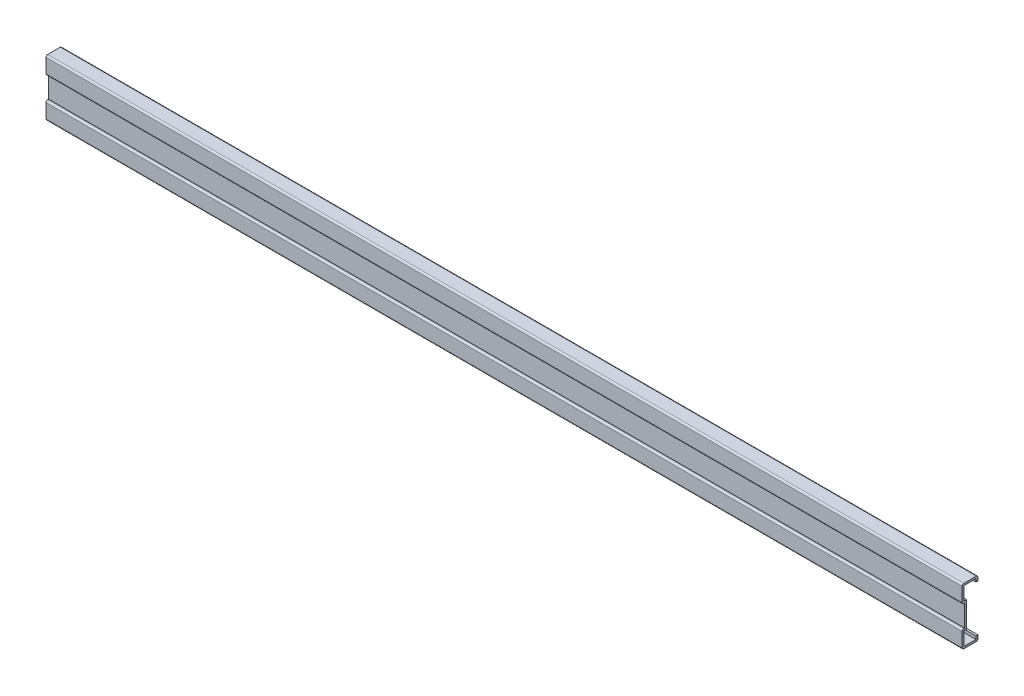
ISO-10303-21;
HEADER;
FILE_DESCRIPTION(('STEP AP214'),'2;1');
FILE_NAME('part.step','',(''),(''),'','','');
FILE_SCHEMA(('AUTOMOTIVE_DESIGN { 1 0 10303 214 1 1 1 1 }'));
ENDSEC;
DATA;
#1=APPLICATION_CONTEXT('core data for automotive mechanical design processes');
#2=APPLICATION_PROTOCOL_DEFINITION('international standard','automotive_design',2000,#1);
#3=PRODUCT_CONTEXT('',#1,'mechanical');
#4=PRODUCT('Part','Part','',(#3));
#5=PRODUCT_RELATED_PRODUCT_CATEGORY('part','',(#4));
#6=PRODUCT_DEFINITION_FORMATION('','',#4);
#7=PRODUCT_DEFINITION_CONTEXT('part definition',#1,'design');
#8=PRODUCT_DEFINITION('design','',#6,#7);
#9=PRODUCT_DEFINITION_SHAPE('','',#8);
#10=(LENGTH_UNIT() NAMED_UNIT(*) SI_UNIT(.MILLI.,.METRE.));
#11=(NAMED_UNIT(*) PLANE_ANGLE_UNIT() SI_UNIT($,.RADIAN.));
#12=(NAMED_UNIT(*) SI_UNIT($,.STERADIAN.) SOLID_ANGLE_UNIT());
#13=UNCERTAINTY_MEASURE_WITH_UNIT(LENGTH_MEASURE(1.E-05),#10,'distance_accuracy_value','');
#14=(GEOMETRIC_REPRESENTATION_CONTEXT(3) GLOBAL_UNCERTAINTY_ASSIGNED_CONTEXT((#13)) GLOBAL_UNIT_ASSIGNED_CONTEXT((#10,
#11,#12)) REPRESENTATION_CONTEXT('',''));
#15=CARTESIAN_POINT('',(0.,0.,0.));
#16=DIRECTION('',(0.,0.,1.));
#17=DIRECTION('',(1.,0.,0.));
#18=AXIS2_PLACEMENT_3D('',#15,#16,#17);
#19=CARTESIAN_POINT('',(550.,16.,-6.8));
#20=DIRECTION('',(0.,0.,-1.));
#21=DIRECTION('',(-1.,0.,0.));
#22=AXIS2_PLACEMENT_3D('',#19,#20,#21);
#23=PLANE('',#22);
#24=DIRECTION('',(0.,1.,0.));
#25=VECTOR('',#24,1.);
#26=CARTESIAN_POINT('',(0.,16.,-6.8));
#27=LINE('',#26,#25);
#28=CARTESIAN_POINT('',(0.,15.8,-6.8));
#29=VERTEX_POINT('',#28);
#30=CARTESIAN_POINT('',(0.,14.,-6.8));
#31=VERTEX_POINT('',#30);
#32=EDGE_CURVE('E237',#29,#31,#27,.F.);
#33=ORIENTED_EDGE('',*,*,#32,.T.);
#34=DIRECTION('',(-1.,0.,0.));
#35=VECTOR('',#34,1.);
#36=CARTESIAN_POINT('',(550.,14.,-6.8));
#37=LINE('',#36,#35);
#38=CARTESIAN_POINT('',(550.,14.,-6.8));
#39=VERTEX_POINT('',#38);
#40=EDGE_CURVE('E11',#39,#31,#37,.T.);
#41=ORIENTED_EDGE('',*,*,#40,.F.);
#42=DIRECTION('',(0.,1.,0.));
#43=VECTOR('',#42,1.);
#44=CARTESIAN_POINT('',(550.,16.,-6.8));
#45=LINE('',#44,#43);
#46=CARTESIAN_POINT('',(550.,15.8,-6.8));
#47=VERTEX_POINT('',#46);
#48=EDGE_CURVE('E144',#47,#39,#45,.F.);
#49=ORIENTED_EDGE('',*,*,#48,.F.);
#50=DIRECTION('',(-1.,0.,0.));
#51=VECTOR('',#50,1.);
#52=CARTESIAN_POINT('',(550.,15.8,-6.8));
#53=LINE('',#52,#51);
#54=EDGE_CURVE('E233',#47,#29,#53,.T.);
#55=ORIENTED_EDGE('',*,*,#54,.T.);
#56=EDGE_LOOP('',(#33,#41,#49,#55));
#57=FACE_BOUND('',#56,.T.);
#58=ADVANCED_FACE('F34',(#57),#23,.F.);
#59=CARTESIAN_POINT('',(550.,14.,-8.));
#60=DIRECTION('',(0.,-1.,0.));
#61=DIRECTION('',(0.,0.,-1.));
#62=AXIS2_PLACEMENT_3D('',#59,#60,#61);
#63=PLANE('',#62);
#64=DIRECTION('',(0.,0.,1.));
#65=VECTOR('',#64,1.);
#66=CARTESIAN_POINT('',(0.,14.,-8.));
#67=LINE('',#66,#65);
#68=CARTESIAN_POINT('',(0.,14.,-8.));
#69=VERTEX_POINT('',#68);
#70=EDGE_CURVE('E240',#69,#31,#67,.T.);
#71=ORIENTED_EDGE('',*,*,#70,.F.);
#72=DIRECTION('',(-1.,0.,0.));
#73=VECTOR('',#72,1.);
#74=CARTESIAN_POINT('',(550.,14.,-8.));
#75=LINE('',#74,#73);
#76=CARTESIAN_POINT('',(550.,14.,-8.));
#77=VERTEX_POINT('',#76);
#78=EDGE_CURVE('E42',#77,#69,#75,.T.);
#79=ORIENTED_EDGE('',*,*,#78,.F.);
#80=DIRECTION('',(0.,0.,1.));
#81=VECTOR('',#80,1.);
#82=CARTESIAN_POINT('',(550.,14.,-8.));
#83=LINE('',#82,#81);
#84=EDGE_CURVE('E372',#77,#39,#83,.T.);
#85=ORIENTED_EDGE('',*,*,#84,.T.);
#86=ORIENTED_EDGE('',*,*,#40,.T.);
#87=EDGE_LOOP('',(#71,#79,#85,#86));
#88=FACE_BOUND('',#87,.T.);
#89=ADVANCED_FACE('F359',(#88),#63,.T.);
#90=CARTESIAN_POINT('',(550.,16.,-8.));
#91=DIRECTION('',(0.,0.,-1.));
#92=DIRECTION('',(-1.,0.,0.));
#93=AXIS2_PLACEMENT_3D('',#90,#91,#92);
#94=PLANE('',#93);
#95=DIRECTION('',(0.,-1.,0.));
#96=VECTOR('',#95,1.);
#97=CARTESIAN_POINT('',(0.,16.,-8.));
#98=LINE('',#97,#96);
#99=CARTESIAN_POINT('',(0.,16.,-8.));
#100=VERTEX_POINT('',#99);
#101=EDGE_CURVE('E243',#100,#69,#98,.T.);
#102=ORIENTED_EDGE('',*,*,#101,.F.);
#103=DIRECTION('',(-1.,0.,0.));
#104=VECTOR('',#103,1.);
#105=CARTESIAN_POINT('',(550.,16.,-8.));
#106=LINE('',#105,#104);
#107=CARTESIAN_POINT('',(550.,16.,-8.));
#108=VERTEX_POINT('',#107);
#109=EDGE_CURVE('E349',#108,#100,#106,.T.);
#110=ORIENTED_EDGE('',*,*,#109,.F.);
#111=DIRECTION('',(0.,-1.,0.));
#112=VECTOR('',#111,1.);
#113=CARTESIAN_POINT('',(550.,16.,-8.));
#114=LINE('',#113,#112);
#115=EDGE_CURVE('E356',#108,#77,#114,.T.);
#116=ORIENTED_EDGE('',*,*,#115,.T.);
#117=ORIENTED_EDGE('',*,*,#78,.T.);
#118=EDGE_LOOP('',(#102,#110,#116,#117));
#119=FACE_BOUND('',#118,.T.);
#120=ADVANCED_FACE('F354',(#119),#94,.T.);
#121=CARTESIAN_POINT('',(550.,16.,-7.));
#122=DIRECTION('',(-1.,0.,0.));
#123=DIRECTION('',(0.,0.,1.));
#124=AXIS2_PLACEMENT_3D('',#121,#122,#123);
#125=CYLINDRICAL_SURFACE('',#124,1.);
#126=CARTESIAN_POINT('',(0.,16.,-7.));
#127=DIRECTION('',(-1.,0.,0.));
#128=DIRECTION('',(0.,0.,1.));
#129=AXIS2_PLACEMENT_3D('',#126,#127,#128);
#130=CIRCLE('',#129,1.);
#131=CARTESIAN_POINT('',(0.,17.,-7.));
#132=VERTEX_POINT('',#131);
#133=EDGE_CURVE('E246',#132,#100,#130,.T.);
#134=ORIENTED_EDGE('',*,*,#133,.F.);
#135=DIRECTION('',(-1.,0.,0.));
#136=VECTOR('',#135,1.);
#137=CARTESIAN_POINT('',(550.,17.,-7.));
#138=LINE('',#137,#136);
#139=CARTESIAN_POINT('',(550.,17.,-7.));
#140=VERTEX_POINT('',#139);
#141=EDGE_CURVE('E347',#140,#132,#138,.T.);
#142=ORIENTED_EDGE('',*,*,#141,.F.);
#143=CARTESIAN_POINT('',(550.,16.,-7.));
#144=DIRECTION('',(-1.,0.,0.));
#145=DIRECTION('',(0.,0.,1.));
#146=AXIS2_PLACEMENT_3D('',#143,#144,#145);
#147=CIRCLE('',#146,1.);
#148=EDGE_CURVE('E369',#140,#108,#147,.T.);
#149=ORIENTED_EDGE('',*,*,#148,.T.);
#150=ORIENTED_EDGE('',*,*,#109,.T.);
#151=EDGE_LOOP('',(#134,#142,#149,#150));
#152=FACE_BOUND('',#151,.T.);
#153=ADVANCED_FACE('F366',(#152),#125,.T.);
#154=CARTESIAN_POINT('',(550.,17.,0.499999999999997));
#155=DIRECTION('',(0.,1.,0.));
#156=DIRECTION('',(0.,0.,1.));
#157=AXIS2_PLACEMENT_3D('',#154,#155,#156);
#158=PLANE('',#157);
#159=DIRECTION('',(0.,0.,-1.));
#160=VECTOR('',#159,1.);
#161=CARTESIAN_POINT('',(0.,17.,0.499999999999997));
#162=LINE('',#161,#160);
#163=CARTESIAN_POINT('',(0.,17.,0.499999999999997));
#164=VERTEX_POINT('',#163);
#165=EDGE_CURVE('E249',#164,#132,#162,.T.);
#166=ORIENTED_EDGE('',*,*,#165,.F.);
#167=DIRECTION('',(-1.,0.,0.));
#168=VECTOR('',#167,1.);
#169=CARTESIAN_POINT('',(550.,17.,0.499999999999997));
#170=LINE('',#169,#168);
#171=CARTESIAN_POINT('',(550.,17.,0.499999999999997));
#172=VERTEX_POINT('',#171);
#173=EDGE_CURVE('E345',#172,#164,#170,.T.);
#174=ORIENTED_EDGE('',*,*,#173,.F.);
#175=DIRECTION('',(0.,0.,-1.));
#176=VECTOR('',#175,1.);
#177=CARTESIAN_POINT('',(550.,17.,0.499999999999997));
#178=LINE('',#177,#176);
#179=EDGE_CURVE('E374',#172,#140,#178,.T.);
#180=ORIENTED_EDGE('',*,*,#179,.T.);
#181=ORIENTED_EDGE('',*,*,#141,.T.);
#182=EDGE_LOOP('',(#166,#174,#180,#181));
#183=FACE_BOUND('',#182,.T.);
#184=ADVANCED_FACE('F458',(#183),#158,.T.);
#185=CARTESIAN_POINT('',(550.,16.,0.499999999999997));
#186=DIRECTION('',(-1.,0.,0.));
#187=DIRECTION('',(0.,0.,1.));
#188=AXIS2_PLACEMENT_3D('',#185,#186,#187);
#189=CYLINDRICAL_SURFACE('',#188,1.);
#190=CARTESIAN_POINT('',(0.,16.,0.499999999999997));
#191=DIRECTION('',(-1.,0.,0.));
#192=DIRECTION('',(0.,0.,1.));
#193=AXIS2_PLACEMENT_3D('',#190,#191,#192);
#194=CIRCLE('',#193,1.);
#195=CARTESIAN_POINT('',(0.,16.,1.5));
#196=VERTEX_POINT('',#195);
#197=EDGE_CURVE('E252',#196,#164,#194,.T.);
#198=ORIENTED_EDGE('',*,*,#197,.F.);
#199=DIRECTION('',(-1.,0.,0.));
#200=VECTOR('',#199,1.);
#201=CARTESIAN_POINT('',(550.,16.,1.5));
#202=LINE('',#201,#200);
#203=CARTESIAN_POINT('',(550.,16.,1.5));
#204=VERTEX_POINT('',#203);
#205=EDGE_CURVE('E343',#204,#196,#202,.T.);
#206=ORIENTED_EDGE('',*,*,#205,.F.);
#207=CARTESIAN_POINT('',(550.,16.,0.499999999999997));
#208=DIRECTION('',(-1.,0.,0.));
#209=DIRECTION('',(0.,0.,1.));
#210=AXIS2_PLACEMENT_3D('',#207,#208,#209);
#211=CIRCLE('',#210,1.);
#212=EDGE_CURVE('E380',#204,#172,#211,.T.);
#213=ORIENTED_EDGE('',*,*,#212,.T.);
#214=ORIENTED_EDGE('',*,*,#173,.T.);
#215=EDGE_LOOP('',(#198,#206,#213,#214));
#216=FACE_BOUND('',#215,.T.);
#217=ADVANCED_FACE('F461',(#216),#189,.T.);
#218=CARTESIAN_POINT('',(550.,7.50000000000001,1.5));
#219=DIRECTION('',(0.,0.,1.));
#220=DIRECTION('',(0.,-1.,0.));
#221=AXIS2_PLACEMENT_3D('',#218,#219,#220);
#222=PLANE('',#221);
#223=DIRECTION('',(0.,1.,0.));
#224=VECTOR('',#223,1.);
#225=CARTESIAN_POINT('',(0.,7.50000000000001,1.5));
#226=LINE('',#225,#224);
#227=CARTESIAN_POINT('',(0.,7.50000000000001,1.5));
#228=VERTEX_POINT('',#227);
#229=EDGE_CURVE('E255',#228,#196,#226,.T.);
#230=ORIENTED_EDGE('',*,*,#229,.F.);
#231=DIRECTION('',(-1.,0.,0.));
#232=VECTOR('',#231,1.);
#233=CARTESIAN_POINT('',(550.,7.50000000000001,1.5));
#234=LINE('',#233,#232);
#235=CARTESIAN_POINT('',(550.,7.50000000000001,1.5));
#236=VERTEX_POINT('',#235);
#237=EDGE_CURVE('E341',#236,#228,#234,.T.);
#238=ORIENTED_EDGE('',*,*,#237,.F.);
#239=DIRECTION('',(0.,1.,0.));
#240=VECTOR('',#239,1.);
#241=CARTESIAN_POINT('',(550.,7.50000000000001,1.5));
#242=LINE('',#241,#240);
#243=EDGE_CURVE('E383',#236,#204,#242,.T.);
#244=ORIENTED_EDGE('',*,*,#243,.T.);
#245=ORIENTED_EDGE('',*,*,#205,.T.);
#246=EDGE_LOOP('',(#230,#238,#244,#245));
#247=FACE_BOUND('',#246,.T.);
#248=ADVANCED_FACE('F465',(#247),#222,.T.);
#249=CARTESIAN_POINT('',(550.,7.5,0.499999999999999));
#250=DIRECTION('',(-1.,0.,0.));
#251=DIRECTION('',(0.,0.,1.));
#252=AXIS2_PLACEMENT_3D('',#249,#250,#251);
#253=CYLINDRICAL_SURFACE('',#252,1.);
#254=CARTESIAN_POINT('',(0.,7.5,0.499999999999999));
#255=DIRECTION('',(-1.,0.,0.));
#256=DIRECTION('',(0.,0.,-1.));
#257=AXIS2_PLACEMENT_3D('',#254,#255,#256);
#258=CIRCLE('',#257,1.);
#259=CARTESIAN_POINT('',(0.,6.5,0.499999999999994));
#260=VERTEX_POINT('',#259);
#261=EDGE_CURVE('E258',#260,#228,#258,.T.);
#262=ORIENTED_EDGE('',*,*,#261,.F.);
#263=DIRECTION('',(-1.,0.,0.));
#264=VECTOR('',#263,1.);
#265=CARTESIAN_POINT('',(550.,6.5,0.499999999999994));
#266=LINE('',#265,#264);
#267=CARTESIAN_POINT('',(550.,6.5,0.499999999999994));
#268=VERTEX_POINT('',#267);
#269=EDGE_CURVE('E339',#268,#260,#266,.T.);
#270=ORIENTED_EDGE('',*,*,#269,.F.);
#271=CARTESIAN_POINT('',(550.,7.5,0.499999999999999));
#272=DIRECTION('',(-1.,0.,0.));
#273=DIRECTION('',(0.,0.,-1.));
#274=AXIS2_PLACEMENT_3D('',#271,#272,#273);
#275=CIRCLE('',#274,1.);
#276=EDGE_CURVE('E386',#268,#236,#275,.T.);
#277=ORIENTED_EDGE('',*,*,#276,.T.);
#278=ORIENTED_EDGE('',*,*,#237,.T.);
#279=EDGE_LOOP('',(#262,#270,#277,#278));
#280=FACE_BOUND('',#279,.T.);
#281=ADVANCED_FACE('F469',(#280),#253,.T.);
#282=CARTESIAN_POINT('',(550.,6.5,0.));
#283=DIRECTION('',(0.,-1.,0.));
#284=DIRECTION('',(0.,0.,-1.));
#285=AXIS2_PLACEMENT_3D('',#282,#283,#284);
#286=PLANE('',#285);
#287=DIRECTION('',(0.,0.,1.));
#288=VECTOR('',#287,1.);
#289=CARTESIAN_POINT('',(0.,6.5,0.));
#290=LINE('',#289,#288);
#291=CARTESIAN_POINT('',(0.,6.5,0.));
#292=VERTEX_POINT('',#291);
#293=EDGE_CURVE('E261',#292,#260,#290,.T.);
#294=ORIENTED_EDGE('',*,*,#293,.F.);
#295=DIRECTION('',(-1.,0.,0.));
#296=VECTOR('',#295,1.);
#297=CARTESIAN_POINT('',(550.,6.5,0.));
#298=LINE('',#297,#296);
#299=CARTESIAN_POINT('',(550.,6.5,0.));
#300=VERTEX_POINT('',#299);
#301=EDGE_CURVE('E337',#300,#292,#298,.T.);
#302=ORIENTED_EDGE('',*,*,#301,.F.);
#303=DIRECTION('',(0.,0.,1.));
#304=VECTOR('',#303,1.);
#305=CARTESIAN_POINT('',(550.,6.5,0.));
#306=LINE('',#305,#304);
#307=EDGE_CURVE('E389',#300,#268,#306,.T.);
#308=ORIENTED_EDGE('',*,*,#307,.T.);
#309=ORIENTED_EDGE('',*,*,#269,.T.);
#310=EDGE_LOOP('',(#294,#302,#308,#309));
#311=FACE_BOUND('',#310,.T.);
#312=ADVANCED_FACE('F473',(#311),#286,.T.);
#313=CARTESIAN_POINT('',(550.,6.5,0.));
#314=DIRECTION('',(0.,0.,1.));
#315=DIRECTION('',(1.,0.,0.));
#316=AXIS2_PLACEMENT_3D('',#313,#314,#315);
#317=PLANE('',#316);
#318=DIRECTION('',(0.,1.,0.));
#319=VECTOR('',#318,1.);
#320=CARTESIAN_POINT('',(0.,6.5,0.));
#321=LINE('',#320,#319);
#322=CARTESIAN_POINT('',(0.,-6.5,0.));
#323=VERTEX_POINT('',#322);
#324=EDGE_CURVE('E264',#323,#292,#321,.T.);
#325=ORIENTED_EDGE('',*,*,#324,.F.);
#326=DIRECTION('',(-1.,0.,0.));
#327=VECTOR('',#326,1.);
#328=CARTESIAN_POINT('',(550.,-6.5,0.));
#329=LINE('',#328,#327);
#330=CARTESIAN_POINT('',(550.,-6.5,0.));
#331=VERTEX_POINT('',#330);
#332=EDGE_CURVE('E335',#331,#323,#329,.T.);
#333=ORIENTED_EDGE('',*,*,#332,.F.);
#334=DIRECTION('',(0.,1.,0.));
#335=VECTOR('',#334,1.);
#336=CARTESIAN_POINT('',(550.,6.5,0.));
#337=LINE('',#336,#335);
#338=EDGE_CURVE('E392',#331,#300,#337,.T.);
#339=ORIENTED_EDGE('',*,*,#338,.T.);
#340=ORIENTED_EDGE('',*,*,#301,.T.);
#341=EDGE_LOOP('',(#325,#333,#339,#340));
#342=FACE_BOUND('',#341,.T.);
#343=ADVANCED_FACE('F477',(#342),#317,.T.);
#344=CARTESIAN_POINT('',(550.,-6.5,0.));
#345=DIRECTION('',(0.,1.,0.));
#346=DIRECTION('',(0.,0.,1.));
#347=AXIS2_PLACEMENT_3D('',#344,#345,#346);
#348=PLANE('',#347);
#349=DIRECTION('',(0.,0.,-1.));
#350=VECTOR('',#349,1.);
#351=CARTESIAN_POINT('',(0.,-6.5,0.));
#352=LINE('',#351,#350);
#353=CARTESIAN_POINT('',(0.,-6.5,0.499999999999994));
#354=VERTEX_POINT('',#353);
#355=EDGE_CURVE('E267',#354,#323,#352,.T.);
#356=ORIENTED_EDGE('',*,*,#355,.F.);
#357=DIRECTION('',(-1.,0.,0.));
#358=VECTOR('',#357,1.);
#359=CARTESIAN_POINT('',(550.,-6.5,0.499999999999994));
#360=LINE('',#359,#358);
#361=CARTESIAN_POINT('',(550.,-6.5,0.499999999999994));
#362=VERTEX_POINT('',#361);
#363=EDGE_CURVE('E333',#362,#354,#360,.T.);
#364=ORIENTED_EDGE('',*,*,#363,.F.);
#365=DIRECTION('',(0.,0.,-1.));
#366=VECTOR('',#365,1.);
#367=CARTESIAN_POINT('',(550.,-6.5,0.));
#368=LINE('',#367,#366);
#369=EDGE_CURVE('E395',#362,#331,#368,.T.);
#370=ORIENTED_EDGE('',*,*,#369,.T.);
#371=ORIENTED_EDGE('',*,*,#332,.T.);
#372=EDGE_LOOP('',(#356,#364,#370,#371));
#373=FACE_BOUND('',#372,.T.);
#374=ADVANCED_FACE('F481',(#373),#348,.T.);
#375=CARTESIAN_POINT('',(550.,-7.5,0.499999999999999));
#376=DIRECTION('',(-1.,0.,0.));
#377=DIRECTION('',(0.,0.,1.));
#378=AXIS2_PLACEMENT_3D('',#375,#376,#377);
#379=CYLINDRICAL_SURFACE('',#378,1.);
#380=CARTESIAN_POINT('',(0.,-7.5,0.499999999999999));
#381=DIRECTION('',(-1.,0.,0.));
#382=DIRECTION('',(0.,0.,1.));
#383=AXIS2_PLACEMENT_3D('',#380,#381,#382);
#384=CIRCLE('',#383,1.);
#385=CARTESIAN_POINT('',(0.,-7.50000000000001,1.5));
#386=VERTEX_POINT('',#385);
#387=EDGE_CURVE('E270',#386,#354,#384,.T.);
#388=ORIENTED_EDGE('',*,*,#387,.F.);
#389=DIRECTION('',(-1.,0.,0.));
#390=VECTOR('',#389,1.);
#391=CARTESIAN_POINT('',(550.,-7.50000000000001,1.5));
#392=LINE('',#391,#390);
#393=CARTESIAN_POINT('',(550.,-7.50000000000001,1.5));
#394=VERTEX_POINT('',#393);
#395=EDGE_CURVE('E331',#394,#386,#392,.T.);
#396=ORIENTED_EDGE('',*,*,#395,.F.);
#397=CARTESIAN_POINT('',(550.,-7.5,0.499999999999999));
#398=DIRECTION('',(-1.,0.,0.));
#399=DIRECTION('',(0.,0.,1.));
#400=AXIS2_PLACEMENT_3D('',#397,#398,#399);
#401=CIRCLE('',#400,1.);
#402=EDGE_CURVE('E398',#394,#362,#401,.T.);
#403=ORIENTED_EDGE('',*,*,#402,.T.);
#404=ORIENTED_EDGE('',*,*,#363,.T.);
#405=EDGE_LOOP('',(#388,#396,#403,#404));
#406=FACE_BOUND('',#405,.T.);
#407=ADVANCED_FACE('F485',(#406),#379,.T.);
#408=CARTESIAN_POINT('',(550.,-7.50000000000001,1.5));
#409=DIRECTION('',(0.,0.,1.));
#410=DIRECTION('',(0.,-1.,0.));
#411=AXIS2_PLACEMENT_3D('',#408,#409,#410);
#412=PLANE('',#411);
#413=DIRECTION('',(0.,1.,0.));
#414=VECTOR('',#413,1.);
#415=CARTESIAN_POINT('',(0.,-7.50000000000001,1.5));
#416=LINE('',#415,#414);
#417=CARTESIAN_POINT('',(0.,-16.,1.5));
#418=VERTEX_POINT('',#417);
#419=EDGE_CURVE('E273',#418,#386,#416,.T.);
#420=ORIENTED_EDGE('',*,*,#419,.F.);
#421=DIRECTION('',(-1.,0.,0.));
#422=VECTOR('',#421,1.);
#423=CARTESIAN_POINT('',(550.,-16.,1.5));
#424=LINE('',#423,#422);
#425=CARTESIAN_POINT('',(550.,-16.,1.5));
#426=VERTEX_POINT('',#425);
#427=EDGE_CURVE('E329',#426,#418,#424,.T.);
#428=ORIENTED_EDGE('',*,*,#427,.F.);
#429=DIRECTION('',(0.,1.,0.));
#430=VECTOR('',#429,1.);
#431=CARTESIAN_POINT('',(550.,-7.50000000000001,1.5));
#432=LINE('',#431,#430);
#433=EDGE_CURVE('E401',#426,#394,#432,.T.);
#434=ORIENTED_EDGE('',*,*,#433,.T.);
#435=ORIENTED_EDGE('',*,*,#395,.T.);
#436=EDGE_LOOP('',(#420,#428,#434,#435));
#437=FACE_BOUND('',#436,.T.);
#438=ADVANCED_FACE('F489',(#437),#412,.T.);
#439=CARTESIAN_POINT('',(550.,-16.,0.499999999999997));
#440=DIRECTION('',(-1.,0.,0.));
#441=DIRECTION('',(0.,0.,1.));
#442=AXIS2_PLACEMENT_3D('',#439,#440,#441);
#443=CYLINDRICAL_SURFACE('',#442,1.);
#444=CARTESIAN_POINT('',(0.,-16.,0.499999999999997));
#445=DIRECTION('',(-1.,0.,0.));
#446=DIRECTION('',(0.,0.,-1.));
#447=AXIS2_PLACEMENT_3D('',#444,#445,#446);
#448=CIRCLE('',#447,1.);
#449=CARTESIAN_POINT('',(0.,-17.,0.499999999999997));
#450=VERTEX_POINT('',#449);
#451=EDGE_CURVE('E276',#450,#418,#448,.T.);
#452=ORIENTED_EDGE('',*,*,#451,.F.);
#453=DIRECTION('',(-1.,0.,0.));
#454=VECTOR('',#453,1.);
#455=CARTESIAN_POINT('',(550.,-17.,0.499999999999997));
#456=LINE('',#455,#454);
#457=CARTESIAN_POINT('',(550.,-17.,0.499999999999997));
#458=VERTEX_POINT('',#457);
#459=EDGE_CURVE('E327',#458,#450,#456,.T.);
#460=ORIENTED_EDGE('',*,*,#459,.F.);
#461=CARTESIAN_POINT('',(550.,-16.,0.499999999999997));
#462=DIRECTION('',(-1.,0.,0.));
#463=DIRECTION('',(0.,0.,-1.));
#464=AXIS2_PLACEMENT_3D('',#461,#462,#463);
#465=CIRCLE('',#464,1.);
#466=EDGE_CURVE('E404',#458,#426,#465,.T.);
#467=ORIENTED_EDGE('',*,*,#466,.T.);
#468=ORIENTED_EDGE('',*,*,#427,.T.);
#469=EDGE_LOOP('',(#452,#460,#467,#468));
#470=FACE_BOUND('',#469,.T.);
#471=ADVANCED_FACE('F493',(#470),#443,.T.);
#472=CARTESIAN_POINT('',(550.,-17.,0.499999999999997));
#473=DIRECTION('',(0.,-1.,0.));
#474=DIRECTION('',(0.,0.,-1.));
#475=AXIS2_PLACEMENT_3D('',#472,#473,#474);
#476=PLANE('',#475);
#477=DIRECTION('',(0.,0.,1.));
#478=VECTOR('',#477,1.);
#479=CARTESIAN_POINT('',(0.,-17.,0.499999999999997));
#480=LINE('',#479,#478);
#481=CARTESIAN_POINT('',(0.,-17.,-7.));
#482=VERTEX_POINT('',#481);
#483=EDGE_CURVE('E279',#482,#450,#480,.T.);
#484=ORIENTED_EDGE('',*,*,#483,.F.);
#485=DIRECTION('',(-1.,0.,0.));
#486=VECTOR('',#485,1.);
#487=CARTESIAN_POINT('',(550.,-17.,-7.));
#488=LINE('',#487,#486);
#489=CARTESIAN_POINT('',(550.,-17.,-7.));
#490=VERTEX_POINT('',#489);
#491=EDGE_CURVE('E325',#490,#482,#488,.T.);
#492=ORIENTED_EDGE('',*,*,#491,.F.);
#493=DIRECTION('',(0.,0.,1.));
#494=VECTOR('',#493,1.);
#495=CARTESIAN_POINT('',(550.,-17.,0.499999999999997));
#496=LINE('',#495,#494);
#497=EDGE_CURVE('E407',#490,#458,#496,.T.);
#498=ORIENTED_EDGE('',*,*,#497,.T.);
#499=ORIENTED_EDGE('',*,*,#459,.T.);
#500=EDGE_LOOP('',(#484,#492,#498,#499));
#501=FACE_BOUND('',#500,.T.);
#502=ADVANCED_FACE('F497',(#501),#476,.T.);
#503=CARTESIAN_POINT('',(550.,-16.,-7.));
#504=DIRECTION('',(-1.,0.,0.));
#505=DIRECTION('',(0.,0.,1.));
#506=AXIS2_PLACEMENT_3D('',#503,#504,#505);
#507=CYLINDRICAL_SURFACE('',#506,1.);
#508=CARTESIAN_POINT('',(0.,-16.,-7.));
#509=DIRECTION('',(-1.,0.,0.));
#510=DIRECTION('',(0.,0.,-1.));
#511=AXIS2_PLACEMENT_3D('',#508,#509,#510);
#512=CIRCLE('',#511,1.);
#513=CARTESIAN_POINT('',(0.,-16.,-8.));
#514=VERTEX_POINT('',#513);
#515=EDGE_CURVE('E282',#514,#482,#512,.T.);
#516=ORIENTED_EDGE('',*,*,#515,.F.);
#517=DIRECTION('',(-1.,0.,0.));
#518=VECTOR('',#517,1.);
#519=CARTESIAN_POINT('',(550.,-16.,-8.));
#520=LINE('',#519,#518);
#521=CARTESIAN_POINT('',(550.,-16.,-8.));
#522=VERTEX_POINT('',#521);
#523=EDGE_CURVE('E323',#522,#514,#520,.T.);
#524=ORIENTED_EDGE('',*,*,#523,.F.);
#525=CARTESIAN_POINT('',(550.,-16.,-7.));
#526=DIRECTION('',(-1.,0.,0.));
#527=DIRECTION('',(0.,0.,-1.));
#528=AXIS2_PLACEMENT_3D('',#525,#526,#527);
#529=CIRCLE('',#528,1.);
#530=EDGE_CURVE('E410',#522,#490,#529,.T.);
#531=ORIENTED_EDGE('',*,*,#530,.T.);
#532=ORIENTED_EDGE('',*,*,#491,.T.);
#533=EDGE_LOOP('',(#516,#524,#531,#532));
#534=FACE_BOUND('',#533,.T.);
#535=ADVANCED_FACE('F501',(#534),#507,.T.);
#536=CARTESIAN_POINT('',(550.,-16.,-8.));
#537=DIRECTION('',(0.,0.,-1.));
#538=DIRECTION('',(-1.,0.,0.));
#539=AXIS2_PLACEMENT_3D('',#536,#537,#538);
#540=PLANE('',#539);
#541=DIRECTION('',(0.,-1.,0.));
#542=VECTOR('',#541,1.);
#543=CARTESIAN_POINT('',(0.,-16.,-8.));
#544=LINE('',#543,#542);
#545=CARTESIAN_POINT('',(0.,-14.,-8.));
#546=VERTEX_POINT('',#545);
#547=EDGE_CURVE('E285',#546,#514,#544,.T.);
#548=ORIENTED_EDGE('',*,*,#547,.F.);
#549=DIRECTION('',(-1.,0.,0.));
#550=VECTOR('',#549,1.);
#551=CARTESIAN_POINT('',(550.,-14.,-8.));
#552=LINE('',#551,#550);
#553=CARTESIAN_POINT('',(550.,-14.,-8.));
#554=VERTEX_POINT('',#553);
#555=EDGE_CURVE('E321',#554,#546,#552,.T.);
#556=ORIENTED_EDGE('',*,*,#555,.F.);
#557=DIRECTION('',(0.,-1.,0.));
#558=VECTOR('',#557,1.);
#559=CARTESIAN_POINT('',(550.,-16.,-8.));
#560=LINE('',#559,#558);
#561=EDGE_CURVE('E413',#554,#522,#560,.T.);
#562=ORIENTED_EDGE('',*,*,#561,.T.);
#563=ORIENTED_EDGE('',*,*,#523,.T.);
#564=EDGE_LOOP('',(#548,#556,#562,#563));
#565=FACE_BOUND('',#564,.T.);
#566=ADVANCED_FACE('F505',(#565),#540,.T.);
#567=CARTESIAN_POINT('',(550.,-14.,-6.8));
#568=DIRECTION('',(0.,1.,0.));
#569=DIRECTION('',(0.,0.,1.));
#570=AXIS2_PLACEMENT_3D('',#567,#568,#569);
#571=PLANE('',#570);
#572=DIRECTION('',(0.,0.,-1.));
#573=VECTOR('',#572,1.);
#574=CARTESIAN_POINT('',(0.,-14.,-6.8));
#575=LINE('',#574,#573);
#576=CARTESIAN_POINT('',(0.,-14.,-6.8));
#577=VERTEX_POINT('',#576);
#578=EDGE_CURVE('E288',#577,#546,#575,.T.);
#579=ORIENTED_EDGE('',*,*,#578,.F.);
#580=DIRECTION('',(-1.,0.,0.));
#581=VECTOR('',#580,1.);
#582=CARTESIAN_POINT('',(550.,-14.,-6.8));
#583=LINE('',#582,#581);
#584=CARTESIAN_POINT('',(550.,-14.,-6.8));
#585=VERTEX_POINT('',#584);
#586=EDGE_CURVE('E319',#585,#577,#583,.T.);
#587=ORIENTED_EDGE('',*,*,#586,.F.);
#588=DIRECTION('',(0.,0.,-1.));
#589=VECTOR('',#588,1.);
#590=CARTESIAN_POINT('',(550.,-14.,-6.8));
#591=LINE('',#590,#589);
#592=EDGE_CURVE('E416',#585,#554,#591,.T.);
#593=ORIENTED_EDGE('',*,*,#592,.T.);
#594=ORIENTED_EDGE('',*,*,#555,.T.);
#595=EDGE_LOOP('',(#579,#587,#593,#594));
#596=FACE_BOUND('',#595,.T.);
#597=ADVANCED_FACE('F509',(#596),#571,.T.);
#598=CARTESIAN_POINT('',(550.,-16.,-6.8));
#599=DIRECTION('',(0.,0.,-1.));
#600=DIRECTION('',(-1.,0.,0.));
#601=AXIS2_PLACEMENT_3D('',#598,#599,#600);
#602=PLANE('',#601);
#603=DIRECTION('',(0.,1.,0.));
#604=VECTOR('',#603,1.);
#605=CARTESIAN_POINT('',(0.,-16.,-6.8));
#606=LINE('',#605,#604);
#607=CARTESIAN_POINT('',(0.,-15.8,-6.8));
#608=VERTEX_POINT('',#607);
#609=EDGE_CURVE('E291',#577,#608,#606,.F.);
#610=ORIENTED_EDGE('',*,*,#609,.T.);
#611=DIRECTION('',(-1.,0.,0.));
#612=VECTOR('',#611,1.);
#613=CARTESIAN_POINT('',(550.,-15.8,-6.8));
#614=LINE('',#613,#612);
#615=CARTESIAN_POINT('',(550.,-15.8,-6.8));
#616=VERTEX_POINT('',#615);
#617=EDGE_CURVE('E316',#616,#608,#614,.T.);
#618=ORIENTED_EDGE('',*,*,#617,.F.);
#619=DIRECTION('',(0.,1.,0.));
#620=VECTOR('',#619,1.);
#621=CARTESIAN_POINT('',(550.,-16.,-6.8));
#622=LINE('',#621,#620);
#623=EDGE_CURVE('E419',#585,#616,#622,.F.);
#624=ORIENTED_EDGE('',*,*,#623,.F.);
#625=ORIENTED_EDGE('',*,*,#586,.T.);
#626=EDGE_LOOP('',(#610,#618,#624,#625));
#627=FACE_BOUND('',#626,.T.);
#628=ADVANCED_FACE('F513',(#627),#602,.F.);
#629=CARTESIAN_POINT('',(550.,-15.8,0.499999999999997));
#630=DIRECTION('',(0.,-1.,0.));
#631=DIRECTION('',(0.,0.,-1.));
#632=AXIS2_PLACEMENT_3D('',#629,#630,#631);
#633=PLANE('',#632);
#634=DIRECTION('',(0.,0.,-1.));
#635=VECTOR('',#634,1.);
#636=CARTESIAN_POINT('',(0.,-15.8,0.499999999999997));
#637=LINE('',#636,#635);
#638=CARTESIAN_POINT('',(0.,-15.8,0.299999999999997));
#639=VERTEX_POINT('',#638);
#640=EDGE_CURVE('E293',#608,#639,#637,.F.);
#641=ORIENTED_EDGE('',*,*,#640,.T.);
#642=DIRECTION('',(-1.,0.,0.));
#643=VECTOR('',#642,1.);
#644=CARTESIAN_POINT('',(550.,-15.8,0.299999999999997));
#645=LINE('',#644,#643);
#646=CARTESIAN_POINT('',(550.,-15.8,0.299999999999997));
#647=VERTEX_POINT('',#646);
#648=EDGE_CURVE('E313',#647,#639,#645,.T.);
#649=ORIENTED_EDGE('',*,*,#648,.F.);
#650=DIRECTION('',(0.,0.,-1.));
#651=VECTOR('',#650,1.);
#652=CARTESIAN_POINT('',(550.,-15.8,0.499999999999997));
#653=LINE('',#652,#651);
#654=EDGE_CURVE('E421',#616,#647,#653,.F.);
#655=ORIENTED_EDGE('',*,*,#654,.F.);
#656=ORIENTED_EDGE('',*,*,#617,.T.);
#657=EDGE_LOOP('',(#641,#649,#655,#656));
#658=FACE_BOUND('',#657,.T.);
#659=ADVANCED_FACE('F517',(#658),#633,.F.);
#660=CARTESIAN_POINT('',(550.,-7.50000000000001,0.299999999999998));
#661=DIRECTION('',(0.,0.,1.));
#662=DIRECTION('',(0.,-1.,0.));
#663=AXIS2_PLACEMENT_3D('',#660,#661,#662);
#664=PLANE('',#663);
#665=DIRECTION('',(0.,1.,0.));
#666=VECTOR('',#665,1.);
#667=CARTESIAN_POINT('',(0.,-7.50000000000001,0.299999999999998));
#668=LINE('',#667,#666);
#669=CARTESIAN_POINT('',(0.,-7.7,0.299999999999998));
#670=VERTEX_POINT('',#669);
#671=EDGE_CURVE('E295',#639,#670,#668,.T.);
#672=ORIENTED_EDGE('',*,*,#671,.T.);
#673=DIRECTION('',(-1.,0.,0.));
#674=VECTOR('',#673,1.);
#675=CARTESIAN_POINT('',(550.,-7.7,0.299999999999998));
#676=LINE('',#675,#674);
#677=CARTESIAN_POINT('',(550.,-7.7,0.299999999999998));
#678=VERTEX_POINT('',#677);
#679=EDGE_CURVE('E310',#678,#670,#676,.T.);
#680=ORIENTED_EDGE('',*,*,#679,.F.);
#681=DIRECTION('',(0.,1.,0.));
#682=VECTOR('',#681,1.);
#683=CARTESIAN_POINT('',(550.,-7.50000000000001,0.299999999999998));
#684=LINE('',#683,#682);
#685=EDGE_CURVE('E423',#647,#678,#684,.T.);
#686=ORIENTED_EDGE('',*,*,#685,.F.);
#687=ORIENTED_EDGE('',*,*,#648,.T.);
#688=EDGE_LOOP('',(#672,#680,#686,#687));
#689=FACE_BOUND('',#688,.T.);
#690=ADVANCED_FACE('F521',(#689),#664,.F.);
#691=CARTESIAN_POINT('',(550.,-7.7,0.));
#692=DIRECTION('',(0.,1.,0.));
#693=DIRECTION('',(0.,0.,1.));
#694=AXIS2_PLACEMENT_3D('',#691,#692,#693);
#695=PLANE('',#694);
#696=DIRECTION('',(0.,0.,-1.));
#697=VECTOR('',#696,1.);
#698=CARTESIAN_POINT('',(0.,-7.7,0.));
#699=LINE('',#698,#697);
#700=CARTESIAN_POINT('',(0.,-7.69999999999999,-1.2));
#701=VERTEX_POINT('',#700);
#702=EDGE_CURVE('E297',#670,#701,#699,.T.);
#703=ORIENTED_EDGE('',*,*,#702,.T.);
#704=DIRECTION('',(-1.,0.,0.));
#705=VECTOR('',#704,1.);
#706=CARTESIAN_POINT('',(550.,-7.69999999999999,-1.2));
#707=LINE('',#706,#705);
#708=CARTESIAN_POINT('',(550.,-7.69999999999999,-1.2));
#709=VERTEX_POINT('',#708);
#710=EDGE_CURVE('E307',#709,#701,#707,.T.);
#711=ORIENTED_EDGE('',*,*,#710,.F.);
#712=DIRECTION('',(0.,0.,-1.));
#713=VECTOR('',#712,1.);
#714=CARTESIAN_POINT('',(550.,-7.7,0.));
#715=LINE('',#714,#713);
#716=EDGE_CURVE('E425',#678,#709,#715,.T.);
#717=ORIENTED_EDGE('',*,*,#716,.F.);
#718=ORIENTED_EDGE('',*,*,#679,.T.);
#719=EDGE_LOOP('',(#703,#711,#717,#718));
#720=FACE_BOUND('',#719,.T.);
#721=ADVANCED_FACE('F431',(#720),#695,.F.);
#722=CARTESIAN_POINT('',(550.,6.5,-1.2));
#723=DIRECTION('',(0.,0.,1.));
#724=DIRECTION('',(1.,0.,0.));
#725=AXIS2_PLACEMENT_3D('',#722,#723,#724);
#726=PLANE('',#725);
#727=DIRECTION('',(0.,1.,0.));
#728=VECTOR('',#727,1.);
#729=CARTESIAN_POINT('',(0.,6.5,-1.2));
#730=LINE('',#729,#728);
#731=CARTESIAN_POINT('',(0.,7.69999999999999,-1.2));
#732=VERTEX_POINT('',#731);
#733=EDGE_CURVE('E299',#701,#732,#730,.T.);
#734=ORIENTED_EDGE('',*,*,#733,.T.);
#735=DIRECTION('',(-1.,0.,0.));
#736=VECTOR('',#735,1.);
#737=CARTESIAN_POINT('',(550.,7.69999999999999,-1.2));
#738=LINE('',#737,#736);
#739=CARTESIAN_POINT('',(550.,7.69999999999999,-1.2));
#740=VERTEX_POINT('',#739);
#741=EDGE_CURVE('E228',#740,#732,#738,.T.);
#742=ORIENTED_EDGE('',*,*,#741,.F.);
#743=DIRECTION('',(0.,1.,0.));
#744=VECTOR('',#743,1.);
#745=CARTESIAN_POINT('',(550.,6.5,-1.2));
#746=LINE('',#745,#744);
#747=EDGE_CURVE('E219',#709,#740,#746,.T.);
#748=ORIENTED_EDGE('',*,*,#747,.F.);
#749=ORIENTED_EDGE('',*,*,#710,.T.);
#750=EDGE_LOOP('',(#734,#742,#748,#749));
#751=FACE_BOUND('',#750,.T.);
#752=ADVANCED_FACE('F435',(#751),#726,.F.);
#753=CARTESIAN_POINT('',(550.,7.7,0.));
#754=DIRECTION('',(0.,-1.,0.));
#755=DIRECTION('',(0.,0.,-1.));
#756=AXIS2_PLACEMENT_3D('',#753,#754,#755);
#757=PLANE('',#756);
#758=DIRECTION('',(0.,0.,1.));
#759=VECTOR('',#758,1.);
#760=CARTESIAN_POINT('',(0.,7.7,0.));
#761=LINE('',#760,#759);
#762=CARTESIAN_POINT('',(0.,7.7,0.299999999999998));
#763=VERTEX_POINT('',#762);
#764=EDGE_CURVE('E227',#732,#763,#761,.T.);
#765=ORIENTED_EDGE('',*,*,#764,.T.);
#766=DIRECTION('',(-1.,0.,0.));
#767=VECTOR('',#766,1.);
#768=CARTESIAN_POINT('',(550.,7.7,0.299999999999998));
#769=LINE('',#768,#767);
#770=CARTESIAN_POINT('',(550.,7.7,0.299999999999998));
#771=VERTEX_POINT('',#770);
#772=EDGE_CURVE('E224',#771,#763,#769,.T.);
#773=ORIENTED_EDGE('',*,*,#772,.F.);
#774=DIRECTION('',(0.,0.,1.));
#775=VECTOR('',#774,1.);
#776=CARTESIAN_POINT('',(550.,7.7,0.));
#777=LINE('',#776,#775);
#778=EDGE_CURVE('E213',#740,#771,#777,.T.);
#779=ORIENTED_EDGE('',*,*,#778,.F.);
#780=ORIENTED_EDGE('',*,*,#741,.T.);
#781=EDGE_LOOP('',(#765,#773,#779,#780));
#782=FACE_BOUND('',#781,.T.);
#783=ADVANCED_FACE('F225',(#782),#757,.F.);
#784=CARTESIAN_POINT('',(550.,7.50000000000001,0.299999999999998));
#785=DIRECTION('',(0.,0.,1.));
#786=DIRECTION('',(0.,-1.,0.));
#787=AXIS2_PLACEMENT_3D('',#784,#785,#786);
#788=PLANE('',#787);
#789=DIRECTION('',(0.,1.,0.));
#790=VECTOR('',#789,1.);
#791=CARTESIAN_POINT('',(0.,7.50000000000001,0.299999999999998));
#792=LINE('',#791,#790);
#793=CARTESIAN_POINT('',(0.,15.8,0.299999999999997));
#794=VERTEX_POINT('',#793);
#795=EDGE_CURVE('E132',#763,#794,#792,.T.);
#796=ORIENTED_EDGE('',*,*,#795,.T.);
#797=DIRECTION('',(-1.,0.,0.));
#798=VECTOR('',#797,1.);
#799=CARTESIAN_POINT('',(550.,15.8,0.299999999999997));
#800=LINE('',#799,#798);
#801=CARTESIAN_POINT('',(550.,15.8,0.299999999999997));
#802=VERTEX_POINT('',#801);
#803=EDGE_CURVE('E229',#802,#794,#800,.T.);
#804=ORIENTED_EDGE('',*,*,#803,.F.);
#805=DIRECTION('',(0.,1.,0.));
#806=VECTOR('',#805,1.);
#807=CARTESIAN_POINT('',(550.,7.50000000000001,0.299999999999998));
#808=LINE('',#807,#806);
#809=EDGE_CURVE('E217',#771,#802,#808,.T.);
#810=ORIENTED_EDGE('',*,*,#809,.F.);
#811=ORIENTED_EDGE('',*,*,#772,.T.);
#812=EDGE_LOOP('',(#796,#804,#810,#811));
#813=FACE_BOUND('',#812,.T.);
#814=ADVANCED_FACE('F231',(#813),#788,.F.);
#815=CARTESIAN_POINT('',(550.,15.8,0.499999999999997));
#816=DIRECTION('',(0.,1.,0.));
#817=DIRECTION('',(0.,0.,1.));
#818=AXIS2_PLACEMENT_3D('',#815,#816,#817);
#819=PLANE('',#818);
#820=DIRECTION('',(0.,0.,-1.));
#821=VECTOR('',#820,1.);
#822=CARTESIAN_POINT('',(0.,15.8,0.499999999999997));
#823=LINE('',#822,#821);
#824=EDGE_CURVE('E138',#794,#29,#823,.T.);
#825=ORIENTED_EDGE('',*,*,#824,.T.);
#826=ORIENTED_EDGE('',*,*,#54,.F.);
#827=DIRECTION('',(0.,0.,-1.));
#828=VECTOR('',#827,1.);
#829=CARTESIAN_POINT('',(550.,15.8,0.499999999999997));
#830=LINE('',#829,#828);
#831=EDGE_CURVE('E50',#802,#47,#830,.T.);
#832=ORIENTED_EDGE('',*,*,#831,.F.);
#833=ORIENTED_EDGE('',*,*,#803,.T.);
#834=EDGE_LOOP('',(#825,#826,#832,#833));
#835=FACE_BOUND('',#834,.T.);
#836=ADVANCED_FACE('F437',(#835),#819,.F.);
#837=CARTESIAN_POINT('',(550.,16.,-7.));
#838=DIRECTION('',(-1.,0.,0.));
#839=DIRECTION('',(0.,0.,1.));
#840=AXIS2_PLACEMENT_3D('',#837,#838,#839);
#841=PLANE('',#840);
#842=ORIENTED_EDGE('',*,*,#48,.T.);
#843=ORIENTED_EDGE('',*,*,#84,.F.);
#844=ORIENTED_EDGE('',*,*,#115,.F.);
#845=ORIENTED_EDGE('',*,*,#148,.F.);
#846=ORIENTED_EDGE('',*,*,#179,.F.);
#847=ORIENTED_EDGE('',*,*,#212,.F.);
#848=ORIENTED_EDGE('',*,*,#243,.F.);
#849=ORIENTED_EDGE('',*,*,#276,.F.);
#850=ORIENTED_EDGE('',*,*,#307,.F.);
#851=ORIENTED_EDGE('',*,*,#338,.F.);
#852=ORIENTED_EDGE('',*,*,#369,.F.);
#853=ORIENTED_EDGE('',*,*,#402,.F.);
#854=ORIENTED_EDGE('',*,*,#433,.F.);
#855=ORIENTED_EDGE('',*,*,#466,.F.);
#856=ORIENTED_EDGE('',*,*,#497,.F.);
#857=ORIENTED_EDGE('',*,*,#530,.F.);
#858=ORIENTED_EDGE('',*,*,#561,.F.);
#859=ORIENTED_EDGE('',*,*,#592,.F.);
#860=ORIENTED_EDGE('',*,*,#623,.T.);
#861=ORIENTED_EDGE('',*,*,#654,.T.);
#862=ORIENTED_EDGE('',*,*,#685,.T.);
#863=ORIENTED_EDGE('',*,*,#716,.T.);
#864=ORIENTED_EDGE('',*,*,#747,.T.);
#865=ORIENTED_EDGE('',*,*,#778,.T.);
#866=ORIENTED_EDGE('',*,*,#809,.T.);
#867=ORIENTED_EDGE('',*,*,#831,.T.);
#868=EDGE_LOOP('',(#842,#843,#844,#845,#846,#847,#848,#849,#850,#851,#852,#853,#854,#855,#856,
#857,#858,#859,#860,#861,#862,#863,#864,#865,#866,#867));
#869=FACE_BOUND('',#868,.T.);
#870=ADVANCED_FACE('F215',(#869),#841,.F.);
#871=CARTESIAN_POINT('',(0.,16.,-7.));
#872=DIRECTION('',(-1.,0.,0.));
#873=DIRECTION('',(0.,0.,1.));
#874=AXIS2_PLACEMENT_3D('',#871,#872,#873);
#875=PLANE('',#874);
#876=ORIENTED_EDGE('',*,*,#32,.F.);
#877=ORIENTED_EDGE('',*,*,#824,.F.);
#878=ORIENTED_EDGE('',*,*,#795,.F.);
#879=ORIENTED_EDGE('',*,*,#764,.F.);
#880=ORIENTED_EDGE('',*,*,#733,.F.);
#881=ORIENTED_EDGE('',*,*,#702,.F.);
#882=ORIENTED_EDGE('',*,*,#671,.F.);
#883=ORIENTED_EDGE('',*,*,#640,.F.);
#884=ORIENTED_EDGE('',*,*,#609,.F.);
#885=ORIENTED_EDGE('',*,*,#578,.T.);
#886=ORIENTED_EDGE('',*,*,#547,.T.);
#887=ORIENTED_EDGE('',*,*,#515,.T.);
#888=ORIENTED_EDGE('',*,*,#483,.T.);
#889=ORIENTED_EDGE('',*,*,#451,.T.);
#890=ORIENTED_EDGE('',*,*,#419,.T.);
#891=ORIENTED_EDGE('',*,*,#387,.T.);
#892=ORIENTED_EDGE('',*,*,#355,.T.);
#893=ORIENTED_EDGE('',*,*,#324,.T.);
#894=ORIENTED_EDGE('',*,*,#293,.T.);
#895=ORIENTED_EDGE('',*,*,#261,.T.);
#896=ORIENTED_EDGE('',*,*,#229,.T.);
#897=ORIENTED_EDGE('',*,*,#197,.T.);
#898=ORIENTED_EDGE('',*,*,#165,.T.);
#899=ORIENTED_EDGE('',*,*,#133,.T.);
#900=ORIENTED_EDGE('',*,*,#101,.T.);
#901=ORIENTED_EDGE('',*,*,#70,.T.);
#902=EDGE_LOOP('',(#876,#877,#878,#879,#880,#881,#882,#883,#884,#885,#886,#887,#888,#889,#890,
#891,#892,#893,#894,#895,#896,#897,#898,#899,#900,#901));
#903=FACE_BOUND('',#902,.T.);
#904=ADVANCED_FACE('F362',(#903),#875,.T.);
#905=CLOSED_SHELL('',(#58,#89,#120,#153,#184,#217,#248,#281,#312,#343,#374,#407,#438,#471,#502,
#535,#566,#597,#628,#659,#690,#721,#752,#783,#814,#836,#870,#904));
#906=MANIFOLD_SOLID_BREP('B2',#905);
#907=ADVANCED_BREP_SHAPE_REPRESENTATION('',(#18,#906),#14);
#908=SHAPE_DEFINITION_REPRESENTATION(#9,#907);
ENDSEC;
END-ISO-10303-21;
